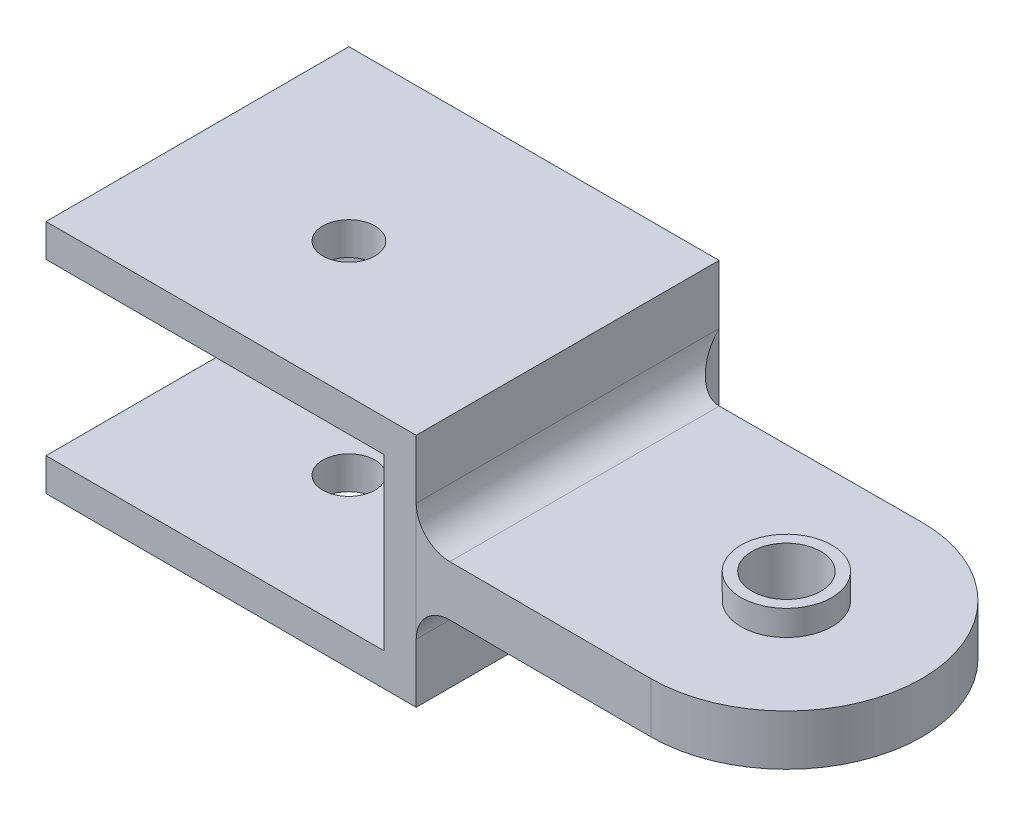
ISO-10303-21;
HEADER;
FILE_DESCRIPTION(('STEP AP214'),'2;1');
FILE_NAME('part.step','',(''),(''),'','','');
FILE_SCHEMA(('AUTOMOTIVE_DESIGN { 1 0 10303 214 1 1 1 1 }'));
ENDSEC;
DATA;
#1=APPLICATION_CONTEXT('core data for automotive mechanical design processes');
#2=APPLICATION_PROTOCOL_DEFINITION('international standard','automotive_design',2000,#1);
#3=PRODUCT_CONTEXT('',#1,'mechanical');
#4=PRODUCT('Part','Part','',(#3));
#5=PRODUCT_RELATED_PRODUCT_CATEGORY('part','',(#4));
#6=PRODUCT_DEFINITION_FORMATION('','',#4);
#7=PRODUCT_DEFINITION_CONTEXT('part definition',#1,'design');
#8=PRODUCT_DEFINITION('design','',#6,#7);
#9=PRODUCT_DEFINITION_SHAPE('','',#8);
#10=(LENGTH_UNIT() NAMED_UNIT(*) SI_UNIT(.MILLI.,.METRE.));
#11=(NAMED_UNIT(*) PLANE_ANGLE_UNIT() SI_UNIT($,.RADIAN.));
#12=(NAMED_UNIT(*) SI_UNIT($,.STERADIAN.) SOLID_ANGLE_UNIT());
#13=UNCERTAINTY_MEASURE_WITH_UNIT(LENGTH_MEASURE(1.E-05),#10,'distance_accuracy_value','');
#14=(GEOMETRIC_REPRESENTATION_CONTEXT(3) GLOBAL_UNCERTAINTY_ASSIGNED_CONTEXT((#13)) GLOBAL_UNIT_ASSIGNED_CONTEXT((#10,
#11,#12)) REPRESENTATION_CONTEXT('',''));
#15=CARTESIAN_POINT('',(0.,0.,0.));
#16=DIRECTION('',(0.,0.,1.));
#17=DIRECTION('',(1.,0.,0.));
#18=AXIS2_PLACEMENT_3D('',#15,#16,#17);
#19=CARTESIAN_POINT('',(0.,7.,-8.));
#20=DIRECTION('',(-1.,0.,0.));
#21=DIRECTION('',(0.,0.,1.));
#22=AXIS2_PLACEMENT_3D('',#19,#20,#21);
#23=PLANE('',#22);
#24=DIRECTION('',(0.,0.,-1.));
#25=VECTOR('',#24,1.);
#26=CARTESIAN_POINT('',(0.,3.5,-8.));
#27=LINE('',#26,#25);
#28=CARTESIAN_POINT('',(0.,3.5,8.));
#29=VERTEX_POINT('',#28);
#30=CARTESIAN_POINT('',(0.,3.5,-10.));
#31=VERTEX_POINT('',#30);
#32=EDGE_CURVE('E273',#29,#31,#27,.T.);
#33=ORIENTED_EDGE('',*,*,#32,.T.);
#34=DIRECTION('',(0.,-1.,0.));
#35=VECTOR('',#34,1.);
#36=CARTESIAN_POINT('',(0.,7.,-10.));
#37=LINE('',#36,#35);
#38=CARTESIAN_POINT('',(0.,7.,-10.));
#39=VERTEX_POINT('',#38);
#40=EDGE_CURVE('E189',#39,#31,#37,.T.);
#41=ORIENTED_EDGE('',*,*,#40,.F.);
#42=DIRECTION('',(0.,0.,-1.));
#43=VECTOR('',#42,1.);
#44=CARTESIAN_POINT('',(0.,7.,-8.));
#45=LINE('',#44,#43);
#46=CARTESIAN_POINT('',(0.,7.,8.));
#47=VERTEX_POINT('',#46);
#48=EDGE_CURVE('E258',#47,#39,#45,.T.);
#49=ORIENTED_EDGE('',*,*,#48,.F.);
#50=DIRECTION('',(0.,-1.,0.));
#51=VECTOR('',#50,1.);
#52=CARTESIAN_POINT('',(0.,7.,8.));
#53=LINE('',#52,#51);
#54=EDGE_CURVE('E266',#47,#29,#53,.T.);
#55=ORIENTED_EDGE('',*,*,#54,.T.);
#56=EDGE_LOOP('',(#33,#41,#49,#55));
#57=FACE_BOUND('',#56,.T.);
#58=ADVANCED_FACE('F38',(#57),#23,.F.);
#59=CARTESIAN_POINT('',(14.,-1.5,0.));
#60=DIRECTION('',(0.,1.,0.));
#61=DIRECTION('',(0.,0.,1.));
#62=AXIS2_PLACEMENT_3D('',#59,#60,#61);
#63=PLANE('',#62);
#64=DIRECTION('',(-0.999993622509989,0.,-0.00357140579467851));
#65=VECTOR('',#64,1.);
#66=CARTESIAN_POINT('',(14.,-1.5,8.05));
#67=LINE('',#66,#65);
#68=CARTESIAN_POINT('',(14.,-1.5,8.05));
#69=VERTEX_POINT('',#68);
#70=CARTESIAN_POINT('',(2.,-1.5,8.00714285714286));
#71=VERTEX_POINT('',#70);
#72=EDGE_CURVE('E236',#69,#71,#67,.T.);
#73=ORIENTED_EDGE('',*,*,#72,.T.);
#74=DIRECTION('',(0.,0.,-1.));
#75=VECTOR('',#74,1.);
#76=CARTESIAN_POINT('',(2.,-1.5,-8.));
#77=LINE('',#76,#75);
#78=CARTESIAN_POINT('',(2.,-1.5,-8.00715556652885));
#79=VERTEX_POINT('',#78);
#80=EDGE_CURVE('E53',#71,#79,#77,.T.);
#81=ORIENTED_EDGE('',*,*,#80,.T.);
#82=CARTESIAN_POINT('',(1.9999871994261,-1.5,-10.0071555664879));
#83=DIRECTION('',(0.,1.,0.));
#84=DIRECTION('',(0.,0.,1.));
#85=AXIS2_PLACEMENT_3D('',#82,#83,#84);
#86=CIRCLE('',#85,2.);
#87=CARTESIAN_POINT('',(2.00713001101545,-1.5,-8.00716832146791));
#88=VERTEX_POINT('',#87);
#89=EDGE_CURVE('E11',#79,#88,#86,.T.);
#90=ORIENTED_EDGE('',*,*,#89,.T.);
#91=DIRECTION('',(0.999993622509989,0.,-0.00357140579467851));
#92=VECTOR('',#91,1.);
#93=CARTESIAN_POINT('',(0.,-1.5,-8.));
#94=LINE('',#93,#92);
#95=CARTESIAN_POINT('',(14.,-1.5,-8.05));
#96=VERTEX_POINT('',#95);
#97=EDGE_CURVE('E239',#88,#96,#94,.T.);
#98=ORIENTED_EDGE('',*,*,#97,.T.);
#99=CARTESIAN_POINT('',(14.,-1.5,0.));
#100=DIRECTION('',(0.,-1.,0.));
#101=DIRECTION('',(0.,0.,1.));
#102=AXIS2_PLACEMENT_3D('',#99,#100,#101);
#103=CIRCLE('',#102,8.05);
#104=EDGE_CURVE('E233',#96,#69,#103,.T.);
#105=ORIENTED_EDGE('',*,*,#104,.T.);
#106=EDGE_LOOP('',(#73,#81,#90,#98,#105));
#107=FACE_BOUND('',#106,.T.);
#108=CARTESIAN_POINT('',(14.,-1.5,0.));
#109=DIRECTION('',(0.,1.,0.));
#110=DIRECTION('',(0.,0.,1.));
#111=AXIS2_PLACEMENT_3D('',#108,#109,#110);
#112=CIRCLE('',#111,2.7);
#113=CARTESIAN_POINT('',(14.,-1.5,2.7));
#114=VERTEX_POINT('',#113);
#115=EDGE_CURVE('E281',#114,#114,#112,.F.);
#116=ORIENTED_EDGE('',*,*,#115,.F.);
#117=EDGE_LOOP('',(#116));
#118=FACE_BOUND('',#117,.T.);
#119=ADVANCED_FACE('F318',(#107,#118),#63,.F.);
#120=CARTESIAN_POINT('',(-12.,7.,8.));
#121=DIRECTION('',(0.,0.,-1.));
#122=DIRECTION('',(-1.,0.,0.));
#123=AXIS2_PLACEMENT_3D('',#120,#121,#122);
#124=PLANE('',#123);
#125=DIRECTION('',(1.,0.,0.));
#126=VECTOR('',#125,1.);
#127=CARTESIAN_POINT('',(-12.,7.,8.));
#128=LINE('',#127,#126);
#129=CARTESIAN_POINT('',(-22.,7.,8.));
#130=VERTEX_POINT('',#129);
#131=EDGE_CURVE('E256',#130,#47,#128,.T.);
#132=ORIENTED_EDGE('',*,*,#131,.F.);
#133=DIRECTION('',(0.,1.,0.));
#134=VECTOR('',#133,1.);
#135=CARTESIAN_POINT('',(-22.,7.,8.));
#136=LINE('',#135,#134);
#137=CARTESIAN_POINT('',(-22.,5.05,8.));
#138=VERTEX_POINT('',#137);
#139=EDGE_CURVE('E206',#138,#130,#136,.T.);
#140=ORIENTED_EDGE('',*,*,#139,.F.);
#141=DIRECTION('',(-1.,0.,0.));
#142=VECTOR('',#141,1.);
#143=CARTESIAN_POINT('',(-1.9,5.05,8.));
#144=LINE('',#143,#142);
#145=CARTESIAN_POINT('',(-1.9,5.05,8.));
#146=VERTEX_POINT('',#145);
#147=EDGE_CURVE('E229',#146,#138,#144,.T.);
#148=ORIENTED_EDGE('',*,*,#147,.F.);
#149=DIRECTION('',(0.,1.,0.));
#150=VECTOR('',#149,1.);
#151=CARTESIAN_POINT('',(-1.9,-5.05,8.));
#152=LINE('',#151,#150);
#153=CARTESIAN_POINT('',(-1.9,-5.05,8.));
#154=VERTEX_POINT('',#153);
#155=EDGE_CURVE('E224',#154,#146,#152,.T.);
#156=ORIENTED_EDGE('',*,*,#155,.F.);
#157=DIRECTION('',(-1.,0.,0.));
#158=VECTOR('',#157,1.);
#159=CARTESIAN_POINT('',(-1.9,-5.05,8.));
#160=LINE('',#159,#158);
#161=CARTESIAN_POINT('',(-22.,-5.05,8.));
#162=VERTEX_POINT('',#161);
#163=EDGE_CURVE('E228',#154,#162,#160,.T.);
#164=ORIENTED_EDGE('',*,*,#163,.T.);
#165=DIRECTION('',(0.,1.,0.));
#166=VECTOR('',#165,1.);
#167=CARTESIAN_POINT('',(-22.,-5.05,8.));
#168=LINE('',#167,#166);
#169=CARTESIAN_POINT('',(-22.,-7.,8.));
#170=VERTEX_POINT('',#169);
#171=EDGE_CURVE('E156',#170,#162,#168,.T.);
#172=ORIENTED_EDGE('',*,*,#171,.F.);
#173=DIRECTION('',(1.,0.,0.));
#174=VECTOR('',#173,1.);
#175=CARTESIAN_POINT('',(-12.,-7.,8.));
#176=LINE('',#175,#174);
#177=CARTESIAN_POINT('',(0.,-7.,8.));
#178=VERTEX_POINT('',#177);
#179=EDGE_CURVE('E255',#170,#178,#176,.T.);
#180=ORIENTED_EDGE('',*,*,#179,.T.);
#181=CARTESIAN_POINT('',(0.,-3.5,8.));
#182=VERTEX_POINT('',#181);
#183=EDGE_CURVE('E261',#182,#178,#53,.T.);
#184=ORIENTED_EDGE('',*,*,#183,.F.);
#185=DIRECTION('',(0.,1.,0.));
#186=VECTOR('',#185,1.);
#187=CARTESIAN_POINT('',(0.,-1.5,8.));
#188=LINE('',#187,#186);
#189=EDGE_CURVE('E250',#182,#29,#188,.T.);
#190=ORIENTED_EDGE('',*,*,#189,.T.);
#191=ORIENTED_EDGE('',*,*,#54,.F.);
#192=EDGE_LOOP('',(#132,#140,#148,#156,#164,#172,#180,#184,#190,#191));
#193=FACE_BOUND('',#192,.T.);
#194=ADVANCED_FACE('F314',(#193),#124,.F.);
#195=CARTESIAN_POINT('',(0.,-3.5,-10.));
#196=VERTEX_POINT('',#195);
#197=CARTESIAN_POINT('',(0.,-7.,-10.));
#198=VERTEX_POINT('',#197);
#199=EDGE_CURVE('E188',#196,#198,#37,.T.);
#200=ORIENTED_EDGE('',*,*,#199,.F.);
#201=DIRECTION('',(0.,0.,-1.));
#202=VECTOR('',#201,1.);
#203=CARTESIAN_POINT('',(0.,-3.5,8.));
#204=LINE('',#203,#202);
#205=EDGE_CURVE('E270',#196,#182,#204,.F.);
#206=ORIENTED_EDGE('',*,*,#205,.T.);
#207=ORIENTED_EDGE('',*,*,#183,.T.);
#208=DIRECTION('',(0.,0.,-1.));
#209=VECTOR('',#208,1.);
#210=CARTESIAN_POINT('',(0.,-7.,-8.));
#211=LINE('',#210,#209);
#212=EDGE_CURVE('E259',#178,#198,#211,.T.);
#213=ORIENTED_EDGE('',*,*,#212,.T.);
#214=EDGE_LOOP('',(#200,#206,#207,#213));
#215=FACE_BOUND('',#214,.T.);
#216=ADVANCED_FACE('F317',(#215),#23,.F.);
#217=CARTESIAN_POINT('',(0.,7.,0.));
#218=DIRECTION('',(0.,1.,0.));
#219=DIRECTION('',(0.,0.,1.));
#220=AXIS2_PLACEMENT_3D('',#217,#218,#219);
#221=PLANE('',#220);
#222=CARTESIAN_POINT('',(-12.,7.,0.));
#223=DIRECTION('',(0.,1.,0.));
#224=DIRECTION('',(0.,0.,1.));
#225=AXIS2_PLACEMENT_3D('',#222,#223,#224);
#226=CIRCLE('',#225,1.55000000000067);
#227=CARTESIAN_POINT('',(-12.,7.,1.55000000000068));
#228=VERTEX_POINT('',#227);
#229=EDGE_CURVE('E178',#228,#228,#226,.T.);
#230=ORIENTED_EDGE('',*,*,#229,.F.);
#231=EDGE_LOOP('',(#230));
#232=FACE_BOUND('',#231,.T.);
#233=ORIENTED_EDGE('',*,*,#48,.T.);
#234=DIRECTION('',(1.,0.,0.));
#235=VECTOR('',#234,1.);
#236=CARTESIAN_POINT('',(0.,7.,-10.));
#237=LINE('',#236,#235);
#238=CARTESIAN_POINT('',(-22.,7.,-10.));
#239=VERTEX_POINT('',#238);
#240=EDGE_CURVE('E158',#239,#39,#237,.T.);
#241=ORIENTED_EDGE('',*,*,#240,.F.);
#242=DIRECTION('',(0.,0.,-1.));
#243=VECTOR('',#242,1.);
#244=CARTESIAN_POINT('',(-22.,7.,-8.));
#245=LINE('',#244,#243);
#246=EDGE_CURVE('E209',#130,#239,#245,.T.);
#247=ORIENTED_EDGE('',*,*,#246,.F.);
#248=ORIENTED_EDGE('',*,*,#131,.T.);
#249=EDGE_LOOP('',(#233,#241,#247,#248));
#250=FACE_BOUND('',#249,.T.);
#251=ADVANCED_FACE('F322',(#232,#250),#221,.T.);
#252=CARTESIAN_POINT('',(0.,-7.,0.));
#253=DIRECTION('',(0.,1.,0.));
#254=DIRECTION('',(0.,0.,1.));
#255=AXIS2_PLACEMENT_3D('',#252,#253,#254);
#256=PLANE('',#255);
#257=CARTESIAN_POINT('',(-12.,-7.,0.));
#258=DIRECTION('',(0.,1.,0.));
#259=DIRECTION('',(0.,0.,1.));
#260=AXIS2_PLACEMENT_3D('',#257,#258,#259);
#261=CIRCLE('',#260,1.55000000000067);
#262=CARTESIAN_POINT('',(-12.,-7.,1.55000000000068));
#263=VERTEX_POINT('',#262);
#264=EDGE_CURVE('E181',#263,#263,#261,.F.);
#265=ORIENTED_EDGE('',*,*,#264,.F.);
#266=EDGE_LOOP('',(#265));
#267=FACE_BOUND('',#266,.T.);
#268=ORIENTED_EDGE('',*,*,#179,.F.);
#269=DIRECTION('',(0.,0.,1.));
#270=VECTOR('',#269,1.);
#271=CARTESIAN_POINT('',(-22.,-7.,-8.));
#272=LINE('',#271,#270);
#273=CARTESIAN_POINT('',(-22.,-7.,-10.));
#274=VERTEX_POINT('',#273);
#275=EDGE_CURVE('E202',#274,#170,#272,.T.);
#276=ORIENTED_EDGE('',*,*,#275,.F.);
#277=DIRECTION('',(-1.,0.,0.));
#278=VECTOR('',#277,1.);
#279=CARTESIAN_POINT('',(0.,-7.,-10.));
#280=LINE('',#279,#278);
#281=EDGE_CURVE('E192',#198,#274,#280,.T.);
#282=ORIENTED_EDGE('',*,*,#281,.F.);
#283=ORIENTED_EDGE('',*,*,#212,.F.);
#284=EDGE_LOOP('',(#268,#276,#282,#283));
#285=FACE_BOUND('',#284,.T.);
#286=ADVANCED_FACE('F324',(#267,#285),#256,.F.);
#287=CARTESIAN_POINT('',(14.,1.5,0.));
#288=DIRECTION('',(0.,1.,0.));
#289=DIRECTION('',(0.,0.,1.));
#290=AXIS2_PLACEMENT_3D('',#287,#288,#289);
#291=PLANE('',#290);
#292=CARTESIAN_POINT('',(14.,1.5,0.));
#293=DIRECTION('',(0.,1.,0.));
#294=DIRECTION('',(0.,0.,1.));
#295=AXIS2_PLACEMENT_3D('',#292,#293,#294);
#296=CIRCLE('',#295,2.7);
#297=CARTESIAN_POINT('',(14.,1.5,2.7));
#298=VERTEX_POINT('',#297);
#299=EDGE_CURVE('E284',#298,#298,#296,.T.);
#300=ORIENTED_EDGE('',*,*,#299,.F.);
#301=EDGE_LOOP('',(#300));
#302=FACE_BOUND('',#301,.T.);
#303=DIRECTION('',(0.999993622509989,0.,-0.00357140579467851));
#304=VECTOR('',#303,1.);
#305=CARTESIAN_POINT('',(0.,1.5,-8.));
#306=LINE('',#305,#304);
#307=CARTESIAN_POINT('',(2.00713001101545,1.5,-8.00716832146791));
#308=VERTEX_POINT('',#307);
#309=CARTESIAN_POINT('',(14.,1.5,-8.05));
#310=VERTEX_POINT('',#309);
#311=EDGE_CURVE('E237',#308,#310,#306,.T.);
#312=ORIENTED_EDGE('',*,*,#311,.F.);
#313=CARTESIAN_POINT('',(1.9999871994261,1.5,-10.0071555664879));
#314=DIRECTION('',(0.,1.,0.));
#315=DIRECTION('',(0.,0.,1.));
#316=AXIS2_PLACEMENT_3D('',#313,#314,#315);
#317=CIRCLE('',#316,2.);
#318=CARTESIAN_POINT('',(2.,1.5,-8.00715556652885));
#319=VERTEX_POINT('',#318);
#320=EDGE_CURVE('E292',#308,#319,#317,.F.);
#321=ORIENTED_EDGE('',*,*,#320,.T.);
#322=DIRECTION('',(0.,0.,-1.));
#323=VECTOR('',#322,1.);
#324=CARTESIAN_POINT('',(2.,1.5,0.));
#325=LINE('',#324,#323);
#326=CARTESIAN_POINT('',(2.,1.5,8.00714285714286));
#327=VERTEX_POINT('',#326);
#328=EDGE_CURVE('E61',#319,#327,#325,.F.);
#329=ORIENTED_EDGE('',*,*,#328,.T.);
#330=DIRECTION('',(-0.999993622509989,0.,-0.00357140579467851));
#331=VECTOR('',#330,1.);
#332=CARTESIAN_POINT('',(14.,1.5,8.05));
#333=LINE('',#332,#331);
#334=CARTESIAN_POINT('',(14.,1.5,8.05));
#335=VERTEX_POINT('',#334);
#336=EDGE_CURVE('E244',#335,#327,#333,.T.);
#337=ORIENTED_EDGE('',*,*,#336,.F.);
#338=CARTESIAN_POINT('',(14.,1.5,0.));
#339=DIRECTION('',(0.,-1.,0.));
#340=DIRECTION('',(0.,0.,1.));
#341=AXIS2_PLACEMENT_3D('',#338,#339,#340);
#342=CIRCLE('',#341,8.05);
#343=EDGE_CURVE('E231',#310,#335,#342,.T.);
#344=ORIENTED_EDGE('',*,*,#343,.F.);
#345=EDGE_LOOP('',(#312,#321,#329,#337,#344));
#346=FACE_BOUND('',#345,.T.);
#347=ADVANCED_FACE('F327',(#302,#346),#291,.T.);
#348=CARTESIAN_POINT('',(14.,-1.5,0.));
#349=DIRECTION('',(0.,1.,0.));
#350=DIRECTION('',(0.,0.,1.));
#351=AXIS2_PLACEMENT_3D('',#348,#349,#350);
#352=CYLINDRICAL_SURFACE('',#351,8.05);
#353=ORIENTED_EDGE('',*,*,#343,.T.);
#354=DIRECTION('',(0.,1.,0.));
#355=VECTOR('',#354,1.);
#356=CARTESIAN_POINT('',(14.,-1.5,8.05));
#357=LINE('',#356,#355);
#358=EDGE_CURVE('E252',#69,#335,#357,.T.);
#359=ORIENTED_EDGE('',*,*,#358,.F.);
#360=ORIENTED_EDGE('',*,*,#104,.F.);
#361=DIRECTION('',(0.,1.,0.));
#362=VECTOR('',#361,1.);
#363=CARTESIAN_POINT('',(14.,-1.5,-8.05));
#364=LINE('',#363,#362);
#365=EDGE_CURVE('E241',#96,#310,#364,.T.);
#366=ORIENTED_EDGE('',*,*,#365,.T.);
#367=EDGE_LOOP('',(#353,#359,#360,#366));
#368=FACE_BOUND('',#367,.T.);
#369=ADVANCED_FACE('F332',(#368),#352,.T.);
#370=CARTESIAN_POINT('',(14.,-1.5,8.05));
#371=DIRECTION('',(0.00357140579467851,0.,-0.999993622509989));
#372=DIRECTION('',(-0.999993622509989,0.,-0.00357140579467851));
#373=AXIS2_PLACEMENT_3D('',#370,#371,#372);
#374=PLANE('',#373);
#375=ORIENTED_EDGE('',*,*,#336,.T.);
#376=CARTESIAN_POINT('',(2.,3.5,8.00714285714286));
#377=DIRECTION('',(0.00357140579467851,0.,-0.999993622509989));
#378=DIRECTION('',(-0.999993622509989,0.,-0.00357140579467851));
#379=AXIS2_PLACEMENT_3D('',#376,#377,#378);
#380=ELLIPSE('',#379,2.00001275506137,2.);
#381=EDGE_CURVE('E278',#327,#29,#380,.T.);
#382=ORIENTED_EDGE('',*,*,#381,.T.);
#383=ORIENTED_EDGE('',*,*,#189,.F.);
#384=CARTESIAN_POINT('',(2.,-3.5,8.00714285714286));
#385=DIRECTION('',(0.00357140579467851,0.,-0.999993622509989));
#386=DIRECTION('',(0.999993622509989,0.,0.00357140579467851));
#387=AXIS2_PLACEMENT_3D('',#384,#385,#386);
#388=ELLIPSE('',#387,2.00001275506137,2.);
#389=EDGE_CURVE('E276',#182,#71,#388,.T.);
#390=ORIENTED_EDGE('',*,*,#389,.T.);
#391=ORIENTED_EDGE('',*,*,#72,.F.);
#392=ORIENTED_EDGE('',*,*,#358,.T.);
#393=EDGE_LOOP('',(#375,#382,#383,#390,#391,#392));
#394=FACE_BOUND('',#393,.T.);
#395=ADVANCED_FACE('F335',(#394),#374,.F.);
#396=CARTESIAN_POINT('',(0.,-1.5,-8.));
#397=DIRECTION('',(0.00357140579467851,0.,0.999993622509989));
#398=DIRECTION('',(0.999993622509989,0.,-0.00357140579467851));
#399=AXIS2_PLACEMENT_3D('',#396,#397,#398);
#400=PLANE('',#399);
#401=ORIENTED_EDGE('',*,*,#97,.F.);
#402=DIRECTION('',(0.,-1.,0.));
#403=VECTOR('',#402,1.);
#404=CARTESIAN_POINT('',(2.00713001101545,-1.5,-8.00716832146791));
#405=LINE('',#404,#403);
#406=EDGE_CURVE('E287',#88,#308,#405,.F.);
#407=ORIENTED_EDGE('',*,*,#406,.T.);
#408=ORIENTED_EDGE('',*,*,#311,.T.);
#409=ORIENTED_EDGE('',*,*,#365,.F.);
#410=EDGE_LOOP('',(#401,#407,#408,#409));
#411=FACE_BOUND('',#410,.T.);
#412=ADVANCED_FACE('F339',(#411),#400,.F.);
#413=CARTESIAN_POINT('',(14.,-1.5,0.));
#414=DIRECTION('',(0.,1.,0.));
#415=DIRECTION('',(0.,0.,1.));
#416=AXIS2_PLACEMENT_3D('',#413,#414,#415);
#417=CYLINDRICAL_SURFACE('',#416,2.05);
#418=CARTESIAN_POINT('',(14.,-3.,0.));
#419=DIRECTION('',(0.,-1.,0.));
#420=DIRECTION('',(0.,0.,-1.));
#421=AXIS2_PLACEMENT_3D('',#418,#419,#420);
#422=CIRCLE('',#421,2.05);
#423=CARTESIAN_POINT('',(14.,-3.,-2.05));
#424=VERTEX_POINT('',#423);
#425=EDGE_CURVE('E217',#424,#424,#422,.T.);
#426=ORIENTED_EDGE('',*,*,#425,.T.);
#427=EDGE_LOOP('',(#426));
#428=FACE_BOUND('',#427,.T.);
#429=CARTESIAN_POINT('',(14.,3.,0.));
#430=DIRECTION('',(0.,-1.,0.));
#431=DIRECTION('',(0.,0.,-1.));
#432=AXIS2_PLACEMENT_3D('',#429,#430,#431);
#433=CIRCLE('',#432,2.05);
#434=CARTESIAN_POINT('',(14.,3.,-2.05));
#435=VERTEX_POINT('',#434);
#436=EDGE_CURVE('E211',#435,#435,#433,.T.);
#437=ORIENTED_EDGE('',*,*,#436,.F.);
#438=EDGE_LOOP('',(#437));
#439=FACE_BOUND('',#438,.T.);
#440=ADVANCED_FACE('F343',(#428,#439),#417,.F.);
#441=CARTESIAN_POINT('',(-1.9,5.05,-8.));
#442=DIRECTION('',(0.,1.,0.));
#443=DIRECTION('',(0.,0.,1.));
#444=AXIS2_PLACEMENT_3D('',#441,#442,#443);
#445=PLANE('',#444);
#446=CARTESIAN_POINT('',(-12.,5.05,0.));
#447=DIRECTION('',(0.,1.,0.));
#448=DIRECTION('',(0.,0.,1.));
#449=AXIS2_PLACEMENT_3D('',#446,#447,#448);
#450=CIRCLE('',#449,1.55000000000067);
#451=CARTESIAN_POINT('',(-12.,5.05,1.55000000000068));
#452=VERTEX_POINT('',#451);
#453=EDGE_CURVE('E185',#452,#452,#450,.T.);
#454=ORIENTED_EDGE('',*,*,#453,.T.);
#455=EDGE_LOOP('',(#454));
#456=FACE_BOUND('',#455,.T.);
#457=ORIENTED_EDGE('',*,*,#147,.T.);
#458=DIRECTION('',(0.,0.,1.));
#459=VECTOR('',#458,1.);
#460=CARTESIAN_POINT('',(-22.,5.05,-8.));
#461=LINE('',#460,#459);
#462=CARTESIAN_POINT('',(-22.,5.05,-8.1));
#463=VERTEX_POINT('',#462);
#464=EDGE_CURVE('E204',#463,#138,#461,.T.);
#465=ORIENTED_EDGE('',*,*,#464,.F.);
#466=DIRECTION('',(-1.,0.,0.));
#467=VECTOR('',#466,1.);
#468=CARTESIAN_POINT('',(-22.,5.05,-8.1));
#469=LINE('',#468,#467);
#470=CARTESIAN_POINT('',(-1.9,5.05,-8.1));
#471=VERTEX_POINT('',#470);
#472=EDGE_CURVE('E173',#471,#463,#469,.T.);
#473=ORIENTED_EDGE('',*,*,#472,.F.);
#474=DIRECTION('',(0.,0.,-1.));
#475=VECTOR('',#474,1.);
#476=CARTESIAN_POINT('',(-1.9,5.05,-8.));
#477=LINE('',#476,#475);
#478=EDGE_CURVE('E226',#146,#471,#477,.T.);
#479=ORIENTED_EDGE('',*,*,#478,.F.);
#480=EDGE_LOOP('',(#457,#465,#473,#479));
#481=FACE_BOUND('',#480,.T.);
#482=ADVANCED_FACE('F352',(#456,#481),#445,.F.);
#483=CARTESIAN_POINT('',(-1.9,-5.05,-8.));
#484=DIRECTION('',(0.,-1.,0.));
#485=DIRECTION('',(0.,0.,-1.));
#486=AXIS2_PLACEMENT_3D('',#483,#484,#485);
#487=PLANE('',#486);
#488=CARTESIAN_POINT('',(-12.,-5.05,0.));
#489=DIRECTION('',(0.,-1.,0.));
#490=DIRECTION('',(0.,0.,-1.));
#491=AXIS2_PLACEMENT_3D('',#488,#489,#490);
#492=CIRCLE('',#491,1.55000000000067);
#493=CARTESIAN_POINT('',(-12.,-5.05,-1.55000000000066));
#494=VERTEX_POINT('',#493);
#495=EDGE_CURVE('E184',#494,#494,#492,.T.);
#496=ORIENTED_EDGE('',*,*,#495,.T.);
#497=EDGE_LOOP('',(#496));
#498=FACE_BOUND('',#497,.T.);
#499=DIRECTION('',(0.,0.,1.));
#500=VECTOR('',#499,1.);
#501=CARTESIAN_POINT('',(-1.9,-5.05,-8.));
#502=LINE('',#501,#500);
#503=CARTESIAN_POINT('',(-1.9,-5.05,-8.1));
#504=VERTEX_POINT('',#503);
#505=EDGE_CURVE('E164',#504,#154,#502,.T.);
#506=ORIENTED_EDGE('',*,*,#505,.F.);
#507=DIRECTION('',(1.,0.,0.));
#508=VECTOR('',#507,1.);
#509=CARTESIAN_POINT('',(-22.,-5.05,-8.1));
#510=LINE('',#509,#508);
#511=CARTESIAN_POINT('',(-22.,-5.05,-8.1));
#512=VERTEX_POINT('',#511);
#513=EDGE_CURVE('E161',#512,#504,#510,.T.);
#514=ORIENTED_EDGE('',*,*,#513,.F.);
#515=DIRECTION('',(0.,0.,-1.));
#516=VECTOR('',#515,1.);
#517=CARTESIAN_POINT('',(-22.,-5.05,-8.));
#518=LINE('',#517,#516);
#519=EDGE_CURVE('E148',#162,#512,#518,.T.);
#520=ORIENTED_EDGE('',*,*,#519,.F.);
#521=ORIENTED_EDGE('',*,*,#163,.F.);
#522=EDGE_LOOP('',(#506,#514,#520,#521));
#523=FACE_BOUND('',#522,.T.);
#524=ADVANCED_FACE('F162',(#498,#523),#487,.F.);
#525=CARTESIAN_POINT('',(-1.9,0.,0.));
#526=DIRECTION('',(1.,0.,0.));
#527=DIRECTION('',(0.,0.,-1.));
#528=AXIS2_PLACEMENT_3D('',#525,#526,#527);
#529=PLANE('',#528);
#530=ORIENTED_EDGE('',*,*,#478,.T.);
#531=DIRECTION('',(0.,1.,0.));
#532=VECTOR('',#531,1.);
#533=CARTESIAN_POINT('',(-1.9,5.05,-8.1));
#534=LINE('',#533,#532);
#535=EDGE_CURVE('E168',#504,#471,#534,.T.);
#536=ORIENTED_EDGE('',*,*,#535,.F.);
#537=ORIENTED_EDGE('',*,*,#505,.T.);
#538=ORIENTED_EDGE('',*,*,#155,.T.);
#539=EDGE_LOOP('',(#530,#536,#537,#538));
#540=FACE_BOUND('',#539,.T.);
#541=ADVANCED_FACE('F312',(#540),#529,.F.);
#542=CARTESIAN_POINT('',(2.,-3.5,0.));
#543=DIRECTION('',(0.,0.,1.));
#544=DIRECTION('',(1.,0.,0.));
#545=AXIS2_PLACEMENT_3D('',#542,#543,#544);
#546=CYLINDRICAL_SURFACE('',#545,2.);
#547=ORIENTED_EDGE('',*,*,#389,.F.);
#548=ORIENTED_EDGE('',*,*,#205,.F.);
#549=CARTESIAN_POINT('',(0.,-3.5,-10.));
#550=CARTESIAN_POINT('',(-6.89683409860145E-09,-3.49943491232863,-10.0000038264276));
#551=CARTESIAN_POINT('',(2.37930254089376E-07,-3.49887794835669,-9.99993317767131));
#552=CARTESIAN_POINT('',(1.14006294786032E-06,-3.49780167909375,-9.99968658775808));
#553=CARTESIAN_POINT('',(1.78656806439259E-06,-3.49728177303916,-9.99951340903822));
#554=CARTESIAN_POINT('',(4.48703920712603E-06,-3.4955996693517,-9.99882773270738));
#555=CARTESIAN_POINT('',(7.26967902568034E-06,-3.4945020454753,-9.99817013926798));
#556=CARTESIAN_POINT('',(1.42687135978599E-05,-3.49237130008263,-9.99672127678162));
#557=CARTESIAN_POINT('',(1.85198094052791E-05,-3.49134053241874,-9.9959270305054));
#558=CARTESIAN_POINT('',(6.78524032318176E-05,-3.48107826095718,-9.98779134814826));
#559=CARTESIAN_POINT('',(0.000165606951877758,-3.47278820215335,-9.97933390535423));
#560=CARTESIAN_POINT('',(0.000913655230565964,-3.43130941833068,-9.93733870076476));
#561=CARTESIAN_POINT('',(0.00234212642015688,-3.3977716254492,-9.90440462724732));
#562=CARTESIAN_POINT('',(0.00914287946531429,-3.29735100091721,-9.80498928969153));
#563=CARTESIAN_POINT('',(0.0170374905005487,-3.23088112237503,-9.73810593915509));
#564=CARTESIAN_POINT('',(0.0396088531205783,-3.09832682981912,-9.60526271822123));
#565=CARTESIAN_POINT('',(0.0542832649759116,-3.03224229078416,-9.5393025373195));
#566=CARTESIAN_POINT('',(0.0908335162492028,-2.90010750568654,-9.40726660103515));
#567=CARTESIAN_POINT('',(0.112813539792789,-2.83407248373135,-9.34120380593105));
#568=CARTESIAN_POINT('',(0.164150777644306,-2.70339365229445,-9.21050828815073));
#569=CARTESIAN_POINT('',(0.193511640685579,-2.63875054812032,-9.1458762900373));
#570=CARTESIAN_POINT('',(0.259911094923879,-2.51144143243052,-9.01857774068319));
#571=CARTESIAN_POINT('',(0.296951205229382,-2.44877581493159,-8.95591158115283));
#572=CARTESIAN_POINT('',(0.379032358298538,-2.32615907727673,-8.83329619967208));
#573=CARTESIAN_POINT('',(0.424068399810225,-2.26620628955951,-8.77334530863963));
#574=CARTESIAN_POINT('',(0.536399950285342,-2.13346512201352,-8.64060738388797));
#575=CARTESIAN_POINT('',(0.60639521083669,-2.06179747680479,-8.56894078080897));
#576=CARTESIAN_POINT('',(0.760885671748402,-1.92675932576715,-8.43390477355731));
#577=CARTESIAN_POINT('',(0.845358669067449,-1.86337637308988,-8.37052292244339));
#578=CARTESIAN_POINT('',(1.01017805625221,-1.75997374094147,-8.2671220622927));
#579=CARTESIAN_POINT('',(1.0878428439226,-1.7178263612003,-8.22497539508866));
#580=CARTESIAN_POINT('',(1.2517764406459,-1.64306164056157,-8.15021205899376));
#581=CARTESIAN_POINT('',(1.3380209006957,-1.6104183072327,-8.11756939777807));
#582=CARTESIAN_POINT('',(1.4726042768275,-1.57021700612043,-8.07736907702251));
#583=CARTESIAN_POINT('',(1.51838145072475,-1.55826992054999,-8.06542231389918));
#584=CARTESIAN_POINT('',(1.61135782819412,-1.53754690252669,-8.04469993562564));
#585=CARTESIAN_POINT('',(1.65855674092701,-1.52877032620499,-8.03592367660762));
#586=CARTESIAN_POINT('',(1.75449240329824,-1.51452790505079,-8.021681889946));
#587=CARTESIAN_POINT('',(1.8032403887296,-1.50909975658032,-8.01625405862434));
#588=CARTESIAN_POINT('',(1.90132074279573,-1.50182567445602,-8.00898060939799));
#589=CARTESIAN_POINT('',(1.95065370079184,-1.49998372947414,-8.00713898016329));
#590=CARTESIAN_POINT('',(2.,-1.5,-8.00715556652885));
#591=B_SPLINE_CURVE_WITH_KNOTS('',3,(#549,#550,#551,#552,#553,#554,#555,#556,#557,#558,#559,
#560,#561,#562,#563,#564,#565,#566,#567,#568,#569,#570,#571,#572,#573,#574,#575,#576,#577,#578,
#579,#580,#581,#582,#583,#584,#585,#586,#587,#588,#589,#590),.UNSPECIFIED.,.F.,.F.,(4,2,2,2,2,2,
2,2,2,2,2,2,2,2,2,2,2,2,2,2,4),(0.,0.00167820423849182,0.003313128269904,0.0071206449903576,
0.0110251051901782,0.0464352007332424,0.187698501610586,0.471141385897658,0.754486526181647,
1.04205940404089,1.32977472468088,1.61754701555762,1.90513994223621,2.27345821306598,
2.6412166046821,2.93385535789414,3.22568609494766,3.37188328673195,3.51805077199359,
3.6658351235926,3.81378375123416),.UNSPECIFIED.);
#592=EDGE_CURVE('E47',#196,#79,#591,.T.);
#593=ORIENTED_EDGE('',*,*,#592,.T.);
#594=ORIENTED_EDGE('',*,*,#80,.F.);
#595=EDGE_LOOP('',(#547,#548,#593,#594));
#596=FACE_BOUND('',#595,.T.);
#597=ADVANCED_FACE('F308',(#596),#546,.F.);
#598=CARTESIAN_POINT('',(2.,3.5,-8.));
#599=DIRECTION('',(0.,0.,-1.));
#600=DIRECTION('',(-1.,0.,0.));
#601=AXIS2_PLACEMENT_3D('',#598,#599,#600);
#602=CYLINDRICAL_SURFACE('',#601,2.);
#603=ORIENTED_EDGE('',*,*,#381,.F.);
#604=ORIENTED_EDGE('',*,*,#328,.F.);
#605=CARTESIAN_POINT('',(2.,1.5,-8.00715556652885));
#606=CARTESIAN_POINT('',(1.95514895387681,1.49998880512623,-8.00714408460947));
#607=CARTESIAN_POINT('',(1.91030651908732,1.50150832685675,-8.00866331932438));
#608=CARTESIAN_POINT('',(1.82105656484736,1.50752258942119,-8.01467700676785));
#609=CARTESIAN_POINT('',(1.77664873276203,1.51201500308583,-8.01916913232816));
#610=CARTESIAN_POINT('',(1.68898650732155,1.52383888457279,-8.03099243736953));
#611=CARTESIAN_POINT('',(1.64572553625213,1.53114602723413,-8.03829929171222));
#612=CARTESIAN_POINT('',(1.56029892016886,1.54844546891177,-8.05559815265791));
#613=CARTESIAN_POINT('',(1.51813343247893,1.5584381512901,-8.06559054262236));
#614=CARTESIAN_POINT('',(1.39395109584193,1.59211474737486,-8.0992662546682));
#615=CARTESIAN_POINT('',(1.31391438059521,1.61954424172433,-8.12669514845189));
#616=CARTESIAN_POINT('',(1.16066581559642,1.68274098081358,-8.18989064591328));
#617=CARTESIAN_POINT('',(1.08746936241992,1.7185264295413,-8.22567545349274));
#618=CARTESIAN_POINT('',(0.920301054699634,1.81274608404479,-8.31989349088053));
#619=CARTESIAN_POINT('',(0.830028138319693,1.87446555212478,-8.38161195307013));
#620=CARTESIAN_POINT('',(0.664618311941231,2.00732922657193,-8.5144733891));
#621=CARTESIAN_POINT('',(0.589515467186682,2.07849406252189,-8.58563699202463));
#622=CARTESIAN_POINT('',(0.427570241844255,2.25622121111506,-8.76336077265123));
#623=CARTESIAN_POINT('',(0.347425467347121,2.36582714537927,-8.87296440759352));
#624=CARTESIAN_POINT('',(0.212916811265033,2.59241998926358,-9.0995507329346));
#625=CARTESIAN_POINT('',(0.15854509767636,2.7094046443535,-9.21653116938719));
#626=CARTESIAN_POINT('',(0.0838481269766221,2.91898332543456,-9.42609776175737));
#627=CARTESIAN_POINT('',(0.0584863454122901,3.01070399149101,-9.51781167507382));
#628=CARTESIAN_POINT('',(0.0281957603586182,3.16030168461702,-9.66738454471134));
#629=CARTESIAN_POINT('',(0.0191640003050453,3.21777390168838,-9.72484397656062));
#630=CARTESIAN_POINT('',(0.00886528829078502,3.30889968918037,-9.81592589204373));
#631=CARTESIAN_POINT('',(0.0059306095921481,3.34245586578058,-9.84946087991718));
#632=CARTESIAN_POINT('',(0.00268485458648311,3.39472701217831,-9.90164579029751));
#633=CARTESIAN_POINT('',(0.00178742641362794,3.41341351857462,-9.92029091151583));
#634=CARTESIAN_POINT('',(0.000808786794790931,3.44223553104222,-9.94896235485833));
#635=CARTESIAN_POINT('',(0.000542016203945243,3.45234626295042,-9.95900389840292));
#636=CARTESIAN_POINT('',(0.000249373208627586,3.46795059390158,-9.97433384219416));
#637=CARTESIAN_POINT('',(0.000169161797388259,3.47340755623487,-9.97966370232443));
#638=CARTESIAN_POINT('',(8.05599642885957E-05,3.48181873120144,-9.98764468057086));
#639=CARTESIAN_POINT('',(5.61850552686435E-05,3.48471239483033,-9.99034950842812));
#640=CARTESIAN_POINT('',(2.90645807926671E-05,3.48912500492435,-9.99415437647866));
#641=CARTESIAN_POINT('',(2.16815259100888E-05,3.49056828750753,-9.99535154243129));
#642=CARTESIAN_POINT('',(9.78127248182927E-06,3.49356665266857,-9.99759341957015));
#643=CARTESIAN_POINT('',(5.21574005724424E-06,3.49511930914345,-9.99864045081694));
#644=CARTESIAN_POINT('',(2.11648049433236E-06,3.49708041070897,-9.99943009883437));
#645=CARTESIAN_POINT('',(1.76209830778447E-06,3.49733296046413,-9.99952285228423));
#646=CARTESIAN_POINT('',(1.14450151371308E-06,3.49784492433771,-9.99968658455005));
#647=CARTESIAN_POINT('',(8.81237109170559E-07,3.49810433462305,-9.9997575752572));
#648=CARTESIAN_POINT('',(2.3007816753275E-07,3.49890146841017,-9.99993497139407));
#649=CARTESIAN_POINT('',(-2.57097456752636E-09,3.49944798909727,-10.0000013943453));
#650=CARTESIAN_POINT('',(0.,3.50000000000003,-9.99999999999993));
#651=B_SPLINE_CURVE_WITH_KNOTS('',3,(#605,#606,#607,#608,#609,#610,#611,#612,#613,#614,#615,
#616,#617,#618,#619,#620,#621,#622,#623,#624,#625,#626,#627,#628,#629,#630,#631,#632,#633,#634,
#635,#636,#637,#638,#639,#640,#641,#642,#643,#644,#645,#646,#647,#648,#649,#650),.UNSPECIFIED.,
.F.,.F.,(4,2,2,2,2,2,2,2,2,2,2,2,2,2,2,2,2,2,2,2,2,2,4),(0.,0.134487653703867,0.268870155283843,
0.402116461627872,0.535381799055875,0.8009045722575,1.06701129185,1.44162617987798,
1.81707315681594,2.33775924874751,2.85828701125433,3.25407198529183,3.49922805079294,
3.64178949257121,3.72102670265396,3.76377659959432,3.78667095196883,3.79853777739677,
3.80417577259591,3.80971414571733,3.81052027112997,3.81132595528664,3.8129697679955),.UNSPECIFIED.);
#652=EDGE_CURVE('E294',#319,#31,#651,.T.);
#653=ORIENTED_EDGE('',*,*,#652,.T.);
#654=ORIENTED_EDGE('',*,*,#32,.F.);
#655=EDGE_LOOP('',(#603,#604,#653,#654));
#656=FACE_BOUND('',#655,.T.);
#657=ADVANCED_FACE('F304',(#656),#602,.F.);
#658=CARTESIAN_POINT('',(14.,-3.,0.));
#659=DIRECTION('',(0.,-1.,0.));
#660=DIRECTION('',(0.,0.,-1.));
#661=AXIS2_PLACEMENT_3D('',#658,#659,#660);
#662=PLANE('',#661);
#663=CARTESIAN_POINT('',(14.,-3.,0.));
#664=DIRECTION('',(0.,-1.,0.));
#665=DIRECTION('',(0.,0.,-1.));
#666=AXIS2_PLACEMENT_3D('',#663,#664,#665);
#667=CIRCLE('',#666,2.7);
#668=CARTESIAN_POINT('',(14.,-3.,-2.7));
#669=VERTEX_POINT('',#668);
#670=EDGE_CURVE('E220',#669,#669,#667,.T.);
#671=ORIENTED_EDGE('',*,*,#670,.T.);
#672=EDGE_LOOP('',(#671));
#673=FACE_BOUND('',#672,.T.);
#674=ORIENTED_EDGE('',*,*,#425,.F.);
#675=EDGE_LOOP('',(#674));
#676=FACE_BOUND('',#675,.T.);
#677=ADVANCED_FACE('F307',(#673,#676),#662,.T.);
#678=CARTESIAN_POINT('',(14.,-3.,0.));
#679=DIRECTION('',(0.,1.,0.));
#680=DIRECTION('',(0.,0.,1.));
#681=AXIS2_PLACEMENT_3D('',#678,#679,#680);
#682=CYLINDRICAL_SURFACE('',#681,2.7);
#683=ORIENTED_EDGE('',*,*,#670,.F.);
#684=EDGE_LOOP('',(#683));
#685=FACE_BOUND('',#684,.T.);
#686=ORIENTED_EDGE('',*,*,#115,.T.);
#687=EDGE_LOOP('',(#686));
#688=FACE_BOUND('',#687,.T.);
#689=ADVANCED_FACE('F363',(#685,#688),#682,.T.);
#690=CARTESIAN_POINT('',(14.,3.,0.));
#691=DIRECTION('',(0.,-1.,0.));
#692=DIRECTION('',(0.,0.,-1.));
#693=AXIS2_PLACEMENT_3D('',#690,#691,#692);
#694=CYLINDRICAL_SURFACE('',#693,2.7);
#695=CARTESIAN_POINT('',(14.,3.,0.));
#696=DIRECTION('',(0.,-1.,0.));
#697=DIRECTION('',(0.,0.,-1.));
#698=AXIS2_PLACEMENT_3D('',#695,#696,#697);
#699=CIRCLE('',#698,2.7);
#700=CARTESIAN_POINT('',(14.,3.,-2.7));
#701=VERTEX_POINT('',#700);
#702=EDGE_CURVE('E214',#701,#701,#699,.T.);
#703=ORIENTED_EDGE('',*,*,#702,.T.);
#704=EDGE_LOOP('',(#703));
#705=FACE_BOUND('',#704,.T.);
#706=ORIENTED_EDGE('',*,*,#299,.T.);
#707=EDGE_LOOP('',(#706));
#708=FACE_BOUND('',#707,.T.);
#709=ADVANCED_FACE('F366',(#705,#708),#694,.T.);
#710=CARTESIAN_POINT('',(14.,3.,0.));
#711=DIRECTION('',(0.,1.,0.));
#712=DIRECTION('',(0.,0.,-1.));
#713=AXIS2_PLACEMENT_3D('',#710,#711,#712);
#714=PLANE('',#713);
#715=ORIENTED_EDGE('',*,*,#436,.T.);
#716=EDGE_LOOP('',(#715));
#717=FACE_BOUND('',#716,.T.);
#718=ORIENTED_EDGE('',*,*,#702,.F.);
#719=EDGE_LOOP('',(#718));
#720=FACE_BOUND('',#719,.T.);
#721=ADVANCED_FACE('F373',(#717,#720),#714,.T.);
#722=CARTESIAN_POINT('',(-22.,0.,0.));
#723=DIRECTION('',(-1.,0.,0.));
#724=DIRECTION('',(0.,0.,1.));
#725=AXIS2_PLACEMENT_3D('',#722,#723,#724);
#726=PLANE('',#725);
#727=DIRECTION('',(0.,-1.,0.));
#728=VECTOR('',#727,1.);
#729=CARTESIAN_POINT('',(-22.,5.05,-8.1));
#730=LINE('',#729,#728);
#731=EDGE_CURVE('E153',#463,#512,#730,.T.);
#732=ORIENTED_EDGE('',*,*,#731,.F.);
#733=ORIENTED_EDGE('',*,*,#464,.T.);
#734=ORIENTED_EDGE('',*,*,#139,.T.);
#735=ORIENTED_EDGE('',*,*,#246,.T.);
#736=DIRECTION('',(0.,1.,0.));
#737=VECTOR('',#736,1.);
#738=CARTESIAN_POINT('',(-22.,7.,-10.));
#739=LINE('',#738,#737);
#740=EDGE_CURVE('E196',#274,#239,#739,.T.);
#741=ORIENTED_EDGE('',*,*,#740,.F.);
#742=ORIENTED_EDGE('',*,*,#275,.T.);
#743=ORIENTED_EDGE('',*,*,#171,.T.);
#744=ORIENTED_EDGE('',*,*,#519,.T.);
#745=EDGE_LOOP('',(#732,#733,#734,#735,#741,#742,#743,#744));
#746=FACE_BOUND('',#745,.T.);
#747=ADVANCED_FACE('F150',(#746),#726,.T.);
#748=CARTESIAN_POINT('',(0.,0.,-10.));
#749=DIRECTION('',(0.,0.,-1.));
#750=DIRECTION('',(-1.,0.,0.));
#751=AXIS2_PLACEMENT_3D('',#748,#749,#750);
#752=PLANE('',#751);
#753=ORIENTED_EDGE('',*,*,#40,.T.);
#754=EDGE_CURVE('E193',#31,#196,#37,.T.);
#755=ORIENTED_EDGE('',*,*,#754,.T.);
#756=ORIENTED_EDGE('',*,*,#199,.T.);
#757=ORIENTED_EDGE('',*,*,#281,.T.);
#758=ORIENTED_EDGE('',*,*,#740,.T.);
#759=ORIENTED_EDGE('',*,*,#240,.T.);
#760=EDGE_LOOP('',(#753,#755,#756,#757,#758,#759));
#761=FACE_BOUND('',#760,.T.);
#762=ADVANCED_FACE('F380',(#761),#752,.T.);
#763=CARTESIAN_POINT('',(-12.,-11.3840620433585,0.));
#764=DIRECTION('',(0.,1.,0.));
#765=DIRECTION('',(0.,0.,1.));
#766=AXIS2_PLACEMENT_3D('',#763,#764,#765);
#767=CYLINDRICAL_SURFACE('',#766,1.55000000000067);
#768=ORIENTED_EDGE('',*,*,#264,.T.);
#769=EDGE_LOOP('',(#768));
#770=FACE_BOUND('',#769,.T.);
#771=ORIENTED_EDGE('',*,*,#495,.F.);
#772=EDGE_LOOP('',(#771));
#773=FACE_BOUND('',#772,.T.);
#774=ADVANCED_FACE('F383',(#770,#773),#767,.F.);
#775=ORIENTED_EDGE('',*,*,#229,.T.);
#776=EDGE_LOOP('',(#775));
#777=FACE_BOUND('',#776,.T.);
#778=ORIENTED_EDGE('',*,*,#453,.F.);
#779=EDGE_LOOP('',(#778));
#780=FACE_BOUND('',#779,.T.);
#781=ADVANCED_FACE('F385',(#777,#780),#767,.F.);
#782=CARTESIAN_POINT('',(0.,0.,-8.1));
#783=DIRECTION('',(0.,0.,1.));
#784=DIRECTION('',(1.,0.,0.));
#785=AXIS2_PLACEMENT_3D('',#782,#783,#784);
#786=PLANE('',#785);
#787=ORIENTED_EDGE('',*,*,#731,.T.);
#788=ORIENTED_EDGE('',*,*,#513,.T.);
#789=ORIENTED_EDGE('',*,*,#535,.T.);
#790=ORIENTED_EDGE('',*,*,#472,.T.);
#791=EDGE_LOOP('',(#787,#788,#789,#790));
#792=FACE_BOUND('',#791,.T.);
#793=ADVANCED_FACE('F171',(#792),#786,.T.);
#794=CARTESIAN_POINT('',(1.9999871994261,7.,-10.0071555664879));
#795=DIRECTION('',(0.,-1.,0.));
#796=DIRECTION('',(0.,0.,-1.));
#797=AXIS2_PLACEMENT_3D('',#794,#795,#796);
#798=CYLINDRICAL_SURFACE('',#797,2.);
#799=ORIENTED_EDGE('',*,*,#592,.F.);
#800=ORIENTED_EDGE('',*,*,#754,.F.);
#801=ORIENTED_EDGE('',*,*,#652,.F.);
#802=ORIENTED_EDGE('',*,*,#320,.F.);
#803=ORIENTED_EDGE('',*,*,#406,.F.);
#804=ORIENTED_EDGE('',*,*,#89,.F.);
#805=EDGE_LOOP('',(#799,#800,#801,#802,#803,#804));
#806=FACE_BOUND('',#805,.T.);
#807=ADVANCED_FACE('F40',(#806),#798,.F.);
#808=CLOSED_SHELL('',(#58,#119,#194,#216,#251,#286,#347,#369,#395,#412,#440,#482,#524,#541,#597,
#657,#677,#689,#709,#721,#747,#762,#774,#781,#793,#807));
#809=MANIFOLD_SOLID_BREP('B2',#808);
#810=ADVANCED_BREP_SHAPE_REPRESENTATION('',(#18,#809),#14);
#811=SHAPE_DEFINITION_REPRESENTATION(#9,#810);
ENDSEC;
END-ISO-10303-21;
